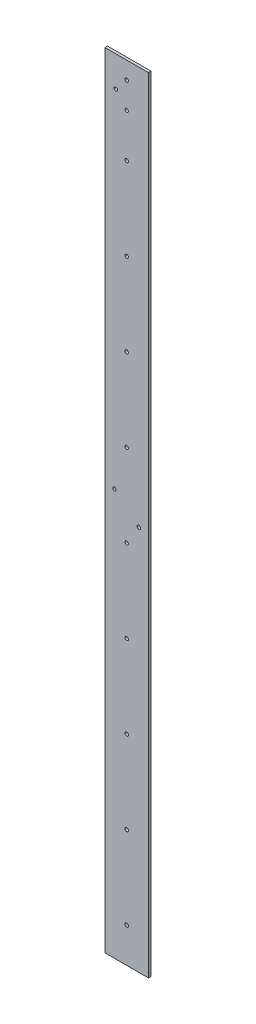
ISO-10303-21;
HEADER;
FILE_DESCRIPTION(('STEP AP214'),'2;1');
FILE_NAME('part.step','',(''),(''),'','','');
FILE_SCHEMA(('AUTOMOTIVE_DESIGN { 1 0 10303 214 1 1 1 1 }'));
ENDSEC;
DATA;
#1=APPLICATION_CONTEXT('core data for automotive mechanical design processes');
#2=APPLICATION_PROTOCOL_DEFINITION('international standard','automotive_design',2000,#1);
#3=PRODUCT_CONTEXT('',#1,'mechanical');
#4=PRODUCT('Part','Part','',(#3));
#5=PRODUCT_RELATED_PRODUCT_CATEGORY('part','',(#4));
#6=PRODUCT_DEFINITION_FORMATION('','',#4);
#7=PRODUCT_DEFINITION_CONTEXT('part definition',#1,'design');
#8=PRODUCT_DEFINITION('design','',#6,#7);
#9=PRODUCT_DEFINITION_SHAPE('','',#8);
#10=(LENGTH_UNIT() NAMED_UNIT(*) SI_UNIT(.MILLI.,.METRE.));
#11=(NAMED_UNIT(*) PLANE_ANGLE_UNIT() SI_UNIT($,.RADIAN.));
#12=(NAMED_UNIT(*) SI_UNIT($,.STERADIAN.) SOLID_ANGLE_UNIT());
#13=UNCERTAINTY_MEASURE_WITH_UNIT(LENGTH_MEASURE(1.E-05),#10,'distance_accuracy_value','');
#14=(GEOMETRIC_REPRESENTATION_CONTEXT(3) GLOBAL_UNCERTAINTY_ASSIGNED_CONTEXT((#13)) GLOBAL_UNIT_ASSIGNED_CONTEXT((#10,
#11,#12)) REPRESENTATION_CONTEXT('',''));
#15=CARTESIAN_POINT('',(0.,0.,0.));
#16=DIRECTION('',(0.,0.,1.));
#17=DIRECTION('',(1.,0.,0.));
#18=AXIS2_PLACEMENT_3D('',#15,#16,#17);
#19=CARTESIAN_POINT('',(-24.6280382553152,450.278971308513,3.));
#20=DIRECTION('',(1.,0.,0.));
#21=DIRECTION('',(0.,1.,0.));
#22=AXIS2_PLACEMENT_3D('',#19,#20,#21);
#23=PLANE('',#22);
#24=DIRECTION('',(0.,-1.,0.));
#25=VECTOR('',#24,1.);
#26=CARTESIAN_POINT('',(-24.6280382553152,450.278971308513,0.));
#27=LINE('',#26,#25);
#28=CARTESIAN_POINT('',(-24.6280382553152,450.278971308513,0.));
#29=VERTEX_POINT('',#28);
#30=CARTESIAN_POINT('',(-24.6280382553117,-449.721028691487,0.));
#31=VERTEX_POINT('',#30);
#32=EDGE_CURVE('E96',#29,#31,#27,.T.);
#33=ORIENTED_EDGE('',*,*,#32,.T.);
#34=DIRECTION('',(0.,0.,-1.));
#35=VECTOR('',#34,1.);
#36=CARTESIAN_POINT('',(-24.6280382553117,-449.721028691487,3.));
#37=LINE('',#36,#35);
#38=CARTESIAN_POINT('',(-24.6280382553117,-449.721028691487,3.));
#39=VERTEX_POINT('',#38);
#40=EDGE_CURVE('E11',#39,#31,#37,.T.);
#41=ORIENTED_EDGE('',*,*,#40,.F.);
#42=DIRECTION('',(0.,-1.,0.));
#43=VECTOR('',#42,1.);
#44=CARTESIAN_POINT('',(-24.6280382553152,450.278971308513,3.));
#45=LINE('',#44,#43);
#46=CARTESIAN_POINT('',(-24.6280382553152,450.278971308513,3.));
#47=VERTEX_POINT('',#46);
#48=EDGE_CURVE('E84',#47,#39,#45,.T.);
#49=ORIENTED_EDGE('',*,*,#48,.F.);
#50=DIRECTION('',(0.,0.,-1.));
#51=VECTOR('',#50,1.);
#52=CARTESIAN_POINT('',(-24.6280382553152,450.278971308513,3.));
#53=LINE('',#52,#51);
#54=EDGE_CURVE('E92',#47,#29,#53,.T.);
#55=ORIENTED_EDGE('',*,*,#54,.T.);
#56=EDGE_LOOP('',(#33,#41,#49,#55));
#57=FACE_BOUND('',#56,.T.);
#58=ADVANCED_FACE('F33',(#57),#23,.F.);
#59=CARTESIAN_POINT('',(-24.6280382553117,-449.721028691487,3.));
#60=DIRECTION('',(0.,1.,0.));
#61=DIRECTION('',(-1.,0.,0.));
#62=AXIS2_PLACEMENT_3D('',#59,#60,#61);
#63=PLANE('',#62);
#64=DIRECTION('',(1.,0.,0.));
#65=VECTOR('',#64,1.);
#66=CARTESIAN_POINT('',(-24.6280382553117,-449.721028691487,0.));
#67=LINE('',#66,#65);
#68=CARTESIAN_POINT('',(25.3719617446855,-449.721028691486,0.));
#69=VERTEX_POINT('',#68);
#70=EDGE_CURVE('E88',#31,#69,#67,.T.);
#71=ORIENTED_EDGE('',*,*,#70,.T.);
#72=DIRECTION('',(0.,0.,-1.));
#73=VECTOR('',#72,1.);
#74=CARTESIAN_POINT('',(25.3719617446855,-449.721028691486,3.));
#75=LINE('',#74,#73);
#76=CARTESIAN_POINT('',(25.3719617446855,-449.721028691486,3.));
#77=VERTEX_POINT('',#76);
#78=EDGE_CURVE('E41',#77,#69,#75,.T.);
#79=ORIENTED_EDGE('',*,*,#78,.F.);
#80=DIRECTION('',(1.,0.,0.));
#81=VECTOR('',#80,1.);
#82=CARTESIAN_POINT('',(-24.6280382553117,-449.721028691487,3.));
#83=LINE('',#82,#81);
#84=EDGE_CURVE('E79',#39,#77,#83,.T.);
#85=ORIENTED_EDGE('',*,*,#84,.F.);
#86=ORIENTED_EDGE('',*,*,#40,.T.);
#87=EDGE_LOOP('',(#71,#79,#85,#86));
#88=FACE_BOUND('',#87,.T.);
#89=ADVANCED_FACE('F87',(#88),#63,.F.);
#90=CARTESIAN_POINT('',(25.3719617446855,-449.721028691486,3.));
#91=DIRECTION('',(-1.,0.,0.));
#92=DIRECTION('',(0.,0.,1.));
#93=AXIS2_PLACEMENT_3D('',#90,#91,#92);
#94=PLANE('',#93);
#95=DIRECTION('',(0.,1.,0.));
#96=VECTOR('',#95,1.);
#97=CARTESIAN_POINT('',(25.3719617446855,-449.721028691486,0.));
#98=LINE('',#97,#96);
#99=CARTESIAN_POINT('',(25.3719617446855,450.278971308513,0.));
#100=VERTEX_POINT('',#99);
#101=EDGE_CURVE('E66',#69,#100,#98,.T.);
#102=ORIENTED_EDGE('',*,*,#101,.T.);
#103=DIRECTION('',(0.,0.,-1.));
#104=VECTOR('',#103,1.);
#105=CARTESIAN_POINT('',(25.3719617446855,450.278971308513,3.));
#106=LINE('',#105,#104);
#107=CARTESIAN_POINT('',(25.3719617446855,450.278971308513,3.));
#108=VERTEX_POINT('',#107);
#109=EDGE_CURVE('E89',#108,#100,#106,.T.);
#110=ORIENTED_EDGE('',*,*,#109,.F.);
#111=DIRECTION('',(0.,1.,0.));
#112=VECTOR('',#111,1.);
#113=CARTESIAN_POINT('',(25.3719617446855,-449.721028691486,3.));
#114=LINE('',#113,#112);
#115=EDGE_CURVE('E82',#77,#108,#114,.T.);
#116=ORIENTED_EDGE('',*,*,#115,.F.);
#117=ORIENTED_EDGE('',*,*,#78,.T.);
#118=EDGE_LOOP('',(#102,#110,#116,#117));
#119=FACE_BOUND('',#118,.T.);
#120=ADVANCED_FACE('F90',(#119),#94,.F.);
#121=CARTESIAN_POINT('',(25.3719617446855,450.278971308513,3.));
#122=DIRECTION('',(0.,-1.,0.));
#123=DIRECTION('',(0.,0.,-1.));
#124=AXIS2_PLACEMENT_3D('',#121,#122,#123);
#125=PLANE('',#124);
#126=DIRECTION('',(-1.,0.,0.));
#127=VECTOR('',#126,1.);
#128=CARTESIAN_POINT('',(25.3719617446855,450.278971308513,0.));
#129=LINE('',#128,#127);
#130=EDGE_CURVE('E72',#100,#29,#129,.T.);
#131=ORIENTED_EDGE('',*,*,#130,.T.);
#132=ORIENTED_EDGE('',*,*,#54,.F.);
#133=DIRECTION('',(-1.,0.,0.));
#134=VECTOR('',#133,1.);
#135=CARTESIAN_POINT('',(25.3719617446855,450.278971308513,3.));
#136=LINE('',#135,#134);
#137=EDGE_CURVE('E49',#108,#47,#136,.T.);
#138=ORIENTED_EDGE('',*,*,#137,.F.);
#139=ORIENTED_EDGE('',*,*,#109,.T.);
#140=EDGE_LOOP('',(#131,#132,#138,#139));
#141=FACE_BOUND('',#140,.T.);
#142=ADVANCED_FACE('F104',(#141),#125,.F.);
#143=CARTESIAN_POINT('',(0.,0.,3.));
#144=DIRECTION('',(0.,0.,1.));
#145=DIRECTION('',(1.,0.,0.));
#146=AXIS2_PLACEMENT_3D('',#143,#144,#145);
#147=PLANE('',#146);
#148=CARTESIAN_POINT('',(0.371961744698737,430.278971308513,3.));
#149=DIRECTION('',(0.,0.,1.));
#150=DIRECTION('',(1.,0.,0.));
#151=AXIS2_PLACEMENT_3D('',#148,#149,#150);
#152=CIRCLE('',#151,1.99999999998372);
#153=CARTESIAN_POINT('',(2.37196174468246,430.278971308513,3.));
#154=VERTEX_POINT('',#153);
#155=EDGE_CURVE('E157',#154,#154,#152,.T.);
#156=ORIENTED_EDGE('',*,*,#155,.F.);
#157=EDGE_LOOP('',(#156));
#158=FACE_BOUND('',#157,.T.);
#159=CARTESIAN_POINT('',(-12.1280382552911,415.278971308477,3.));
#160=DIRECTION('',(0.,0.,1.));
#161=DIRECTION('',(1.,0.,0.));
#162=AXIS2_PLACEMENT_3D('',#159,#160,#161);
#163=CIRCLE('',#162,1.99999999998599);
#164=CARTESIAN_POINT('',(-10.1280382553051,415.278971308477,3.));
#165=VERTEX_POINT('',#164);
#166=EDGE_CURVE('E151',#165,#165,#163,.T.);
#167=ORIENTED_EDGE('',*,*,#166,.F.);
#168=EDGE_LOOP('',(#167));
#169=FACE_BOUND('',#168,.T.);
#170=CARTESIAN_POINT('',(0.371961744685135,350.278971308442,3.));
#171=DIRECTION('',(0.,0.,1.));
#172=DIRECTION('',(1.,0.,0.));
#173=AXIS2_PLACEMENT_3D('',#170,#171,#172);
#174=CIRCLE('',#173,2.00000000002091);
#175=CARTESIAN_POINT('',(2.37196174470604,350.278971308442,3.));
#176=VERTEX_POINT('',#175);
#177=EDGE_CURVE('E145',#176,#176,#174,.T.);
#178=ORIENTED_EDGE('',*,*,#177,.F.);
#179=EDGE_LOOP('',(#178));
#180=FACE_BOUND('',#179,.T.);
#181=CARTESIAN_POINT('',(0.37196174468613,255.278971308442,3.));
#182=DIRECTION('',(0.,0.,1.));
#183=DIRECTION('',(1.,0.,0.));
#184=AXIS2_PLACEMENT_3D('',#181,#182,#183);
#185=CIRCLE('',#184,2.0000000000209);
#186=CARTESIAN_POINT('',(2.37196174470704,255.278971308442,3.));
#187=VERTEX_POINT('',#186);
#188=EDGE_CURVE('E139',#187,#187,#185,.T.);
#189=ORIENTED_EDGE('',*,*,#188,.F.);
#190=EDGE_LOOP('',(#189));
#191=FACE_BOUND('',#190,.T.);
#192=CARTESIAN_POINT('',(0.371961744687126,160.278971308442,3.));
#193=DIRECTION('',(0.,0.,1.));
#194=DIRECTION('',(1.,0.,0.));
#195=AXIS2_PLACEMENT_3D('',#192,#193,#194);
#196=CIRCLE('',#195,2.00000000002091);
#197=CARTESIAN_POINT('',(2.37196174470803,160.278971308442,3.));
#198=VERTEX_POINT('',#197);
#199=EDGE_CURVE('E133',#198,#198,#196,.T.);
#200=ORIENTED_EDGE('',*,*,#199,.F.);
#201=EDGE_LOOP('',(#200));
#202=FACE_BOUND('',#201,.T.);
#203=CARTESIAN_POINT('',(0.371961744688121,65.2789713084417,3.));
#204=DIRECTION('',(0.,0.,1.));
#205=DIRECTION('',(1.,0.,0.));
#206=AXIS2_PLACEMENT_3D('',#203,#204,#205);
#207=CIRCLE('',#206,2.0000000000209);
#208=CARTESIAN_POINT('',(2.37196174470903,65.2789713084417,3.));
#209=VERTEX_POINT('',#208);
#210=EDGE_CURVE('E127',#209,#209,#207,.T.);
#211=ORIENTED_EDGE('',*,*,#210,.F.);
#212=EDGE_LOOP('',(#211));
#213=FACE_BOUND('',#212,.T.);
#214=CARTESIAN_POINT('',(0.371961744689116,-29.7210286915583,3.));
#215=DIRECTION('',(0.,0.,1.));
#216=DIRECTION('',(1.,0.,0.));
#217=AXIS2_PLACEMENT_3D('',#214,#215,#216);
#218=CIRCLE('',#217,2.00000000002091);
#219=CARTESIAN_POINT('',(2.37196174471002,-29.7210286915583,3.));
#220=VERTEX_POINT('',#219);
#221=EDGE_CURVE('E119',#220,#220,#218,.T.);
#222=ORIENTED_EDGE('',*,*,#221,.F.);
#223=EDGE_LOOP('',(#222));
#224=FACE_BOUND('',#223,.T.);
#225=CARTESIAN_POINT('',(0.371961744690111,-124.721028691558,3.));
#226=DIRECTION('',(0.,0.,1.));
#227=DIRECTION('',(1.,0.,0.));
#228=AXIS2_PLACEMENT_3D('',#225,#226,#227);
#229=CIRCLE('',#228,2.00000000002091);
#230=CARTESIAN_POINT('',(2.37196174471102,-124.721028691558,3.));
#231=VERTEX_POINT('',#230);
#232=EDGE_CURVE('E120',#231,#231,#229,.T.);
#233=ORIENTED_EDGE('',*,*,#232,.F.);
#234=EDGE_LOOP('',(#233));
#235=FACE_BOUND('',#234,.T.);
#236=CARTESIAN_POINT('',(14.3719617446852,-7.20091070659768,3.));
#237=DIRECTION('',(0.,0.,1.));
#238=DIRECTION('',(1.,0.,0.));
#239=AXIS2_PLACEMENT_3D('',#236,#237,#238);
#240=CIRCLE('',#239,2.);
#241=CARTESIAN_POINT('',(16.3719617446852,-7.20091070659768,3.));
#242=VERTEX_POINT('',#241);
#243=EDGE_CURVE('E167',#242,#242,#240,.T.);
#244=ORIENTED_EDGE('',*,*,#243,.F.);
#245=EDGE_LOOP('',(#244));
#246=FACE_BOUND('',#245,.T.);
#247=CARTESIAN_POINT('',(0.371961744693096,-409.721028691558,3.));
#248=DIRECTION('',(0.,0.,1.));
#249=DIRECTION('',(1.,0.,0.));
#250=AXIS2_PLACEMENT_3D('',#247,#248,#249);
#251=CIRCLE('',#250,2.00000000002091);
#252=CARTESIAN_POINT('',(2.371961744714,-409.721028691558,3.));
#253=VERTEX_POINT('',#252);
#254=EDGE_CURVE('E186',#253,#253,#251,.T.);
#255=ORIENTED_EDGE('',*,*,#254,.F.);
#256=EDGE_LOOP('',(#255));
#257=FACE_BOUND('',#256,.T.);
#258=CARTESIAN_POINT('',(0.371961744692101,-314.721028691558,3.));
#259=DIRECTION('',(0.,0.,1.));
#260=DIRECTION('',(1.,0.,0.));
#261=AXIS2_PLACEMENT_3D('',#258,#259,#260);
#262=CIRCLE('',#261,2.00000000002091);
#263=CARTESIAN_POINT('',(2.37196174471301,-314.721028691558,3.));
#264=VERTEX_POINT('',#263);
#265=EDGE_CURVE('E175',#264,#264,#262,.T.);
#266=ORIENTED_EDGE('',*,*,#265,.F.);
#267=EDGE_LOOP('',(#266));
#268=FACE_BOUND('',#267,.T.);
#269=CARTESIAN_POINT('',(0.371961744691106,-219.721028691558,3.));
#270=DIRECTION('',(0.,0.,1.));
#271=DIRECTION('',(1.,0.,0.));
#272=AXIS2_PLACEMENT_3D('',#269,#270,#271);
#273=CIRCLE('',#272,2.00000000002091);
#274=CARTESIAN_POINT('',(2.37196174471201,-219.721028691558,3.));
#275=VERTEX_POINT('',#274);
#276=EDGE_CURVE('E174',#275,#275,#273,.T.);
#277=ORIENTED_EDGE('',*,*,#276,.F.);
#278=EDGE_LOOP('',(#277));
#279=FACE_BOUND('',#278,.T.);
#280=CARTESIAN_POINT('',(-13.6280382553148,16.9275078752907,3.));
#281=DIRECTION('',(0.,0.,1.));
#282=DIRECTION('',(1.,0.,0.));
#283=AXIS2_PLACEMENT_3D('',#280,#281,#282);
#284=CIRCLE('',#283,2.);
#285=CARTESIAN_POINT('',(-11.6280382553148,16.9275078752907,3.));
#286=VERTEX_POINT('',#285);
#287=EDGE_CURVE('E168',#286,#286,#284,.T.);
#288=ORIENTED_EDGE('',*,*,#287,.F.);
#289=EDGE_LOOP('',(#288));
#290=FACE_BOUND('',#289,.T.);
#291=CARTESIAN_POINT('',(0.371961744698751,400.278971308442,3.));
#292=DIRECTION('',(0.,0.,1.));
#293=DIRECTION('',(1.,0.,0.));
#294=AXIS2_PLACEMENT_3D('',#291,#292,#293);
#295=CIRCLE('',#294,2.00000000000463);
#296=CARTESIAN_POINT('',(2.37196174470338,400.278971308442,3.));
#297=VERTEX_POINT('',#296);
#298=EDGE_CURVE('E112',#297,#297,#295,.T.);
#299=ORIENTED_EDGE('',*,*,#298,.F.);
#300=EDGE_LOOP('',(#299));
#301=FACE_BOUND('',#300,.T.);
#302=ORIENTED_EDGE('',*,*,#48,.T.);
#303=ORIENTED_EDGE('',*,*,#84,.T.);
#304=ORIENTED_EDGE('',*,*,#115,.T.);
#305=ORIENTED_EDGE('',*,*,#137,.T.);
#306=EDGE_LOOP('',(#302,#303,#304,#305));
#307=FACE_BOUND('',#306,.T.);
#308=ADVANCED_FACE('F80',(#158,#169,#180,#191,#202,#213,#224,#235,#246,#257,#268,#279,#290,#301,
#307),#147,.T.);
#309=CARTESIAN_POINT('',(0.,0.,0.));
#310=DIRECTION('',(0.,0.,1.));
#311=DIRECTION('',(1.,0.,0.));
#312=AXIS2_PLACEMENT_3D('',#309,#310,#311);
#313=PLANE('',#312);
#314=CARTESIAN_POINT('',(0.371961744698737,430.278971308513,0.));
#315=DIRECTION('',(0.,0.,1.));
#316=DIRECTION('',(1.,0.,0.));
#317=AXIS2_PLACEMENT_3D('',#314,#315,#316);
#318=CIRCLE('',#317,1.99999999998372);
#319=CARTESIAN_POINT('',(2.37196174468246,430.278971308513,0.));
#320=VERTEX_POINT('',#319);
#321=EDGE_CURVE('E115',#320,#320,#318,.F.);
#322=ORIENTED_EDGE('',*,*,#321,.F.);
#323=EDGE_LOOP('',(#322));
#324=FACE_BOUND('',#323,.T.);
#325=CARTESIAN_POINT('',(-12.1280382552911,415.278971308477,0.));
#326=DIRECTION('',(0.,0.,1.));
#327=DIRECTION('',(1.,0.,0.));
#328=AXIS2_PLACEMENT_3D('',#325,#326,#327);
#329=CIRCLE('',#328,1.99999999998599);
#330=CARTESIAN_POINT('',(-10.1280382553051,415.278971308477,0.));
#331=VERTEX_POINT('',#330);
#332=EDGE_CURVE('E154',#331,#331,#329,.F.);
#333=ORIENTED_EDGE('',*,*,#332,.F.);
#334=EDGE_LOOP('',(#333));
#335=FACE_BOUND('',#334,.T.);
#336=CARTESIAN_POINT('',(0.371961744685135,350.278971308442,0.));
#337=DIRECTION('',(0.,0.,1.));
#338=DIRECTION('',(1.,0.,0.));
#339=AXIS2_PLACEMENT_3D('',#336,#337,#338);
#340=CIRCLE('',#339,2.00000000002091);
#341=CARTESIAN_POINT('',(2.37196174470604,350.278971308442,0.));
#342=VERTEX_POINT('',#341);
#343=EDGE_CURVE('E148',#342,#342,#340,.F.);
#344=ORIENTED_EDGE('',*,*,#343,.F.);
#345=EDGE_LOOP('',(#344));
#346=FACE_BOUND('',#345,.T.);
#347=CARTESIAN_POINT('',(0.37196174468613,255.278971308442,0.));
#348=DIRECTION('',(0.,0.,1.));
#349=DIRECTION('',(1.,0.,0.));
#350=AXIS2_PLACEMENT_3D('',#347,#348,#349);
#351=CIRCLE('',#350,2.0000000000209);
#352=CARTESIAN_POINT('',(2.37196174470704,255.278971308442,0.));
#353=VERTEX_POINT('',#352);
#354=EDGE_CURVE('E142',#353,#353,#351,.F.);
#355=ORIENTED_EDGE('',*,*,#354,.F.);
#356=EDGE_LOOP('',(#355));
#357=FACE_BOUND('',#356,.T.);
#358=CARTESIAN_POINT('',(0.371961744687126,160.278971308442,0.));
#359=DIRECTION('',(0.,0.,1.));
#360=DIRECTION('',(1.,0.,0.));
#361=AXIS2_PLACEMENT_3D('',#358,#359,#360);
#362=CIRCLE('',#361,2.00000000002091);
#363=CARTESIAN_POINT('',(2.37196174470803,160.278971308442,0.));
#364=VERTEX_POINT('',#363);
#365=EDGE_CURVE('E136',#364,#364,#362,.F.);
#366=ORIENTED_EDGE('',*,*,#365,.F.);
#367=EDGE_LOOP('',(#366));
#368=FACE_BOUND('',#367,.T.);
#369=CARTESIAN_POINT('',(0.371961744688121,65.2789713084417,0.));
#370=DIRECTION('',(0.,0.,1.));
#371=DIRECTION('',(1.,0.,0.));
#372=AXIS2_PLACEMENT_3D('',#369,#370,#371);
#373=CIRCLE('',#372,2.0000000000209);
#374=CARTESIAN_POINT('',(2.37196174470903,65.2789713084417,0.));
#375=VERTEX_POINT('',#374);
#376=EDGE_CURVE('E130',#375,#375,#373,.F.);
#377=ORIENTED_EDGE('',*,*,#376,.F.);
#378=EDGE_LOOP('',(#377));
#379=FACE_BOUND('',#378,.T.);
#380=CARTESIAN_POINT('',(0.371961744689116,-29.7210286915583,0.));
#381=DIRECTION('',(0.,0.,1.));
#382=DIRECTION('',(1.,0.,0.));
#383=AXIS2_PLACEMENT_3D('',#380,#381,#382);
#384=CIRCLE('',#383,2.00000000002091);
#385=CARTESIAN_POINT('',(2.37196174471002,-29.7210286915583,0.));
#386=VERTEX_POINT('',#385);
#387=EDGE_CURVE('E124',#386,#386,#384,.F.);
#388=ORIENTED_EDGE('',*,*,#387,.F.);
#389=EDGE_LOOP('',(#388));
#390=FACE_BOUND('',#389,.T.);
#391=CARTESIAN_POINT('',(0.371961744690111,-124.721028691558,0.));
#392=DIRECTION('',(0.,0.,1.));
#393=DIRECTION('',(1.,0.,0.));
#394=AXIS2_PLACEMENT_3D('',#391,#392,#393);
#395=CIRCLE('',#394,2.00000000002091);
#396=CARTESIAN_POINT('',(2.37196174471102,-124.721028691558,0.));
#397=VERTEX_POINT('',#396);
#398=EDGE_CURVE('E116',#397,#397,#395,.F.);
#399=ORIENTED_EDGE('',*,*,#398,.F.);
#400=EDGE_LOOP('',(#399));
#401=FACE_BOUND('',#400,.T.);
#402=CARTESIAN_POINT('',(14.3719617446852,-7.20091070659768,0.));
#403=DIRECTION('',(0.,0.,1.));
#404=DIRECTION('',(1.,0.,0.));
#405=AXIS2_PLACEMENT_3D('',#402,#403,#404);
#406=CIRCLE('',#405,2.);
#407=CARTESIAN_POINT('',(16.3719617446852,-7.20091070659768,0.));
#408=VERTEX_POINT('',#407);
#409=EDGE_CURVE('E183',#408,#408,#406,.F.);
#410=ORIENTED_EDGE('',*,*,#409,.F.);
#411=EDGE_LOOP('',(#410));
#412=FACE_BOUND('',#411,.T.);
#413=CARTESIAN_POINT('',(0.371961744693096,-409.721028691558,0.));
#414=DIRECTION('',(0.,0.,1.));
#415=DIRECTION('',(1.,0.,0.));
#416=AXIS2_PLACEMENT_3D('',#413,#414,#415);
#417=CIRCLE('',#416,2.00000000002091);
#418=CARTESIAN_POINT('',(2.371961744714,-409.721028691558,0.));
#419=VERTEX_POINT('',#418);
#420=EDGE_CURVE('E178',#419,#419,#417,.F.);
#421=ORIENTED_EDGE('',*,*,#420,.F.);
#422=EDGE_LOOP('',(#421));
#423=FACE_BOUND('',#422,.T.);
#424=CARTESIAN_POINT('',(0.371961744692101,-314.721028691558,0.));
#425=DIRECTION('',(0.,0.,1.));
#426=DIRECTION('',(1.,0.,0.));
#427=AXIS2_PLACEMENT_3D('',#424,#425,#426);
#428=CIRCLE('',#427,2.00000000002091);
#429=CARTESIAN_POINT('',(2.37196174471301,-314.721028691558,0.));
#430=VERTEX_POINT('',#429);
#431=EDGE_CURVE('E171',#430,#430,#428,.F.);
#432=ORIENTED_EDGE('',*,*,#431,.F.);
#433=EDGE_LOOP('',(#432));
#434=FACE_BOUND('',#433,.T.);
#435=CARTESIAN_POINT('',(0.371961744691106,-219.721028691558,0.));
#436=DIRECTION('',(0.,0.,1.));
#437=DIRECTION('',(1.,0.,0.));
#438=AXIS2_PLACEMENT_3D('',#435,#436,#437);
#439=CIRCLE('',#438,2.00000000002091);
#440=CARTESIAN_POINT('',(2.37196174471201,-219.721028691558,0.));
#441=VERTEX_POINT('',#440);
#442=EDGE_CURVE('E123',#441,#441,#439,.F.);
#443=ORIENTED_EDGE('',*,*,#442,.F.);
#444=EDGE_LOOP('',(#443));
#445=FACE_BOUND('',#444,.T.);
#446=CARTESIAN_POINT('',(-13.6280382553148,16.9275078752907,0.));
#447=DIRECTION('',(0.,0.,1.));
#448=DIRECTION('',(1.,0.,0.));
#449=AXIS2_PLACEMENT_3D('',#446,#447,#448);
#450=CIRCLE('',#449,2.);
#451=CARTESIAN_POINT('',(-11.6280382553148,16.9275078752907,0.));
#452=VERTEX_POINT('',#451);
#453=EDGE_CURVE('E164',#452,#452,#450,.F.);
#454=ORIENTED_EDGE('',*,*,#453,.F.);
#455=EDGE_LOOP('',(#454));
#456=FACE_BOUND('',#455,.T.);
#457=CARTESIAN_POINT('',(0.371961744698751,400.278971308442,0.));
#458=DIRECTION('',(0.,0.,1.));
#459=DIRECTION('',(1.,0.,0.));
#460=AXIS2_PLACEMENT_3D('',#457,#458,#459);
#461=CIRCLE('',#460,2.00000000000463);
#462=CARTESIAN_POINT('',(2.37196174470338,400.278971308442,0.));
#463=VERTEX_POINT('',#462);
#464=EDGE_CURVE('E99',#463,#463,#461,.F.);
#465=ORIENTED_EDGE('',*,*,#464,.F.);
#466=EDGE_LOOP('',(#465));
#467=FACE_BOUND('',#466,.T.);
#468=ORIENTED_EDGE('',*,*,#32,.F.);
#469=ORIENTED_EDGE('',*,*,#130,.F.);
#470=ORIENTED_EDGE('',*,*,#101,.F.);
#471=ORIENTED_EDGE('',*,*,#70,.F.);
#472=EDGE_LOOP('',(#468,#469,#470,#471));
#473=FACE_BOUND('',#472,.T.);
#474=ADVANCED_FACE('F107',(#324,#335,#346,#357,#368,#379,#390,#401,#412,#423,#434,#445,#456,
#467,#473),#313,.F.);
#475=CARTESIAN_POINT('',(0.371961744698751,400.278971308442,-0.00100000000000013));
#476=DIRECTION('',(0.,0.,1.));
#477=DIRECTION('',(1.,0.,0.));
#478=AXIS2_PLACEMENT_3D('',#475,#476,#477);
#479=CYLINDRICAL_SURFACE('',#478,2.00000000000463);
#480=ORIENTED_EDGE('',*,*,#298,.T.);
#481=EDGE_LOOP('',(#480));
#482=FACE_BOUND('',#481,.T.);
#483=ORIENTED_EDGE('',*,*,#464,.T.);
#484=EDGE_LOOP('',(#483));
#485=FACE_BOUND('',#484,.T.);
#486=ADVANCED_FACE('F209',(#482,#485),#479,.F.);
#487=CARTESIAN_POINT('',(-13.6280382553148,16.9275078752907,-0.00100000000000013));
#488=DIRECTION('',(0.,0.,1.));
#489=DIRECTION('',(1.,0.,0.));
#490=AXIS2_PLACEMENT_3D('',#487,#488,#489);
#491=CYLINDRICAL_SURFACE('',#490,2.);
#492=ORIENTED_EDGE('',*,*,#287,.T.);
#493=EDGE_LOOP('',(#492));
#494=FACE_BOUND('',#493,.T.);
#495=ORIENTED_EDGE('',*,*,#453,.T.);
#496=EDGE_LOOP('',(#495));
#497=FACE_BOUND('',#496,.T.);
#498=ADVANCED_FACE('F212',(#494,#497),#491,.F.);
#499=CARTESIAN_POINT('',(0.371961744691106,-219.721028691558,-0.00100000000000013));
#500=DIRECTION('',(0.,0.,1.));
#501=DIRECTION('',(1.,0.,0.));
#502=AXIS2_PLACEMENT_3D('',#499,#500,#501);
#503=CYLINDRICAL_SURFACE('',#502,2.00000000002091);
#504=ORIENTED_EDGE('',*,*,#276,.T.);
#505=EDGE_LOOP('',(#504));
#506=FACE_BOUND('',#505,.T.);
#507=ORIENTED_EDGE('',*,*,#442,.T.);
#508=EDGE_LOOP('',(#507));
#509=FACE_BOUND('',#508,.T.);
#510=ADVANCED_FACE('F260',(#506,#509),#503,.F.);
#511=CARTESIAN_POINT('',(0.371961744692101,-314.721028691558,-0.00100000000000013));
#512=DIRECTION('',(0.,0.,1.));
#513=DIRECTION('',(1.,0.,0.));
#514=AXIS2_PLACEMENT_3D('',#511,#512,#513);
#515=CYLINDRICAL_SURFACE('',#514,2.00000000002091);
#516=ORIENTED_EDGE('',*,*,#265,.T.);
#517=EDGE_LOOP('',(#516));
#518=FACE_BOUND('',#517,.T.);
#519=ORIENTED_EDGE('',*,*,#431,.T.);
#520=EDGE_LOOP('',(#519));
#521=FACE_BOUND('',#520,.T.);
#522=ADVANCED_FACE('F270',(#518,#521),#515,.F.);
#523=CARTESIAN_POINT('',(0.371961744693096,-409.721028691558,-0.00100000000000013));
#524=DIRECTION('',(0.,0.,1.));
#525=DIRECTION('',(1.,0.,0.));
#526=AXIS2_PLACEMENT_3D('',#523,#524,#525);
#527=CYLINDRICAL_SURFACE('',#526,2.00000000002091);
#528=ORIENTED_EDGE('',*,*,#254,.T.);
#529=EDGE_LOOP('',(#528));
#530=FACE_BOUND('',#529,.T.);
#531=ORIENTED_EDGE('',*,*,#420,.T.);
#532=EDGE_LOOP('',(#531));
#533=FACE_BOUND('',#532,.T.);
#534=ADVANCED_FACE('F194',(#530,#533),#527,.F.);
#535=CARTESIAN_POINT('',(14.3719617446852,-7.20091070659768,-0.00100000000000013));
#536=DIRECTION('',(0.,0.,1.));
#537=DIRECTION('',(1.,0.,0.));
#538=AXIS2_PLACEMENT_3D('',#535,#536,#537);
#539=CYLINDRICAL_SURFACE('',#538,2.);
#540=ORIENTED_EDGE('',*,*,#243,.T.);
#541=EDGE_LOOP('',(#540));
#542=FACE_BOUND('',#541,.T.);
#543=ORIENTED_EDGE('',*,*,#409,.T.);
#544=EDGE_LOOP('',(#543));
#545=FACE_BOUND('',#544,.T.);
#546=ADVANCED_FACE('F289',(#542,#545),#539,.F.);
#547=CARTESIAN_POINT('',(0.371961744690111,-124.721028691558,-0.00100000000000013));
#548=DIRECTION('',(0.,0.,1.));
#549=DIRECTION('',(1.,0.,0.));
#550=AXIS2_PLACEMENT_3D('',#547,#548,#549);
#551=CYLINDRICAL_SURFACE('',#550,2.00000000002091);
#552=ORIENTED_EDGE('',*,*,#232,.T.);
#553=EDGE_LOOP('',(#552));
#554=FACE_BOUND('',#553,.T.);
#555=ORIENTED_EDGE('',*,*,#398,.T.);
#556=EDGE_LOOP('',(#555));
#557=FACE_BOUND('',#556,.T.);
#558=ADVANCED_FACE('F298',(#554,#557),#551,.F.);
#559=CARTESIAN_POINT('',(0.371961744689116,-29.7210286915583,-0.00100000000000013));
#560=DIRECTION('',(0.,0.,1.));
#561=DIRECTION('',(1.,0.,0.));
#562=AXIS2_PLACEMENT_3D('',#559,#560,#561);
#563=CYLINDRICAL_SURFACE('',#562,2.00000000002091);
#564=ORIENTED_EDGE('',*,*,#221,.T.);
#565=EDGE_LOOP('',(#564));
#566=FACE_BOUND('',#565,.T.);
#567=ORIENTED_EDGE('',*,*,#387,.T.);
#568=EDGE_LOOP('',(#567));
#569=FACE_BOUND('',#568,.T.);
#570=ADVANCED_FACE('F308',(#566,#569),#563,.F.);
#571=CARTESIAN_POINT('',(0.371961744688121,65.2789713084417,-0.00100000000000013));
#572=DIRECTION('',(0.,0.,1.));
#573=DIRECTION('',(1.,0.,0.));
#574=AXIS2_PLACEMENT_3D('',#571,#572,#573);
#575=CYLINDRICAL_SURFACE('',#574,2.0000000000209);
#576=ORIENTED_EDGE('',*,*,#210,.T.);
#577=EDGE_LOOP('',(#576));
#578=FACE_BOUND('',#577,.T.);
#579=ORIENTED_EDGE('',*,*,#376,.T.);
#580=EDGE_LOOP('',(#579));
#581=FACE_BOUND('',#580,.T.);
#582=ADVANCED_FACE('F318',(#578,#581),#575,.F.);
#583=CARTESIAN_POINT('',(0.371961744687126,160.278971308442,-0.00100000000000013));
#584=DIRECTION('',(0.,0.,1.));
#585=DIRECTION('',(1.,0.,0.));
#586=AXIS2_PLACEMENT_3D('',#583,#584,#585);
#587=CYLINDRICAL_SURFACE('',#586,2.00000000002091);
#588=ORIENTED_EDGE('',*,*,#199,.T.);
#589=EDGE_LOOP('',(#588));
#590=FACE_BOUND('',#589,.T.);
#591=ORIENTED_EDGE('',*,*,#365,.T.);
#592=EDGE_LOOP('',(#591));
#593=FACE_BOUND('',#592,.T.);
#594=ADVANCED_FACE('F328',(#590,#593),#587,.F.);
#595=CARTESIAN_POINT('',(0.37196174468613,255.278971308442,-0.00100000000000013));
#596=DIRECTION('',(0.,0.,1.));
#597=DIRECTION('',(1.,0.,0.));
#598=AXIS2_PLACEMENT_3D('',#595,#596,#597);
#599=CYLINDRICAL_SURFACE('',#598,2.0000000000209);
#600=ORIENTED_EDGE('',*,*,#188,.T.);
#601=EDGE_LOOP('',(#600));
#602=FACE_BOUND('',#601,.T.);
#603=ORIENTED_EDGE('',*,*,#354,.T.);
#604=EDGE_LOOP('',(#603));
#605=FACE_BOUND('',#604,.T.);
#606=ADVANCED_FACE('F338',(#602,#605),#599,.F.);
#607=CARTESIAN_POINT('',(0.371961744685135,350.278971308442,-0.00100000000000013));
#608=DIRECTION('',(0.,0.,1.));
#609=DIRECTION('',(1.,0.,0.));
#610=AXIS2_PLACEMENT_3D('',#607,#608,#609);
#611=CYLINDRICAL_SURFACE('',#610,2.00000000002091);
#612=ORIENTED_EDGE('',*,*,#177,.T.);
#613=EDGE_LOOP('',(#612));
#614=FACE_BOUND('',#613,.T.);
#615=ORIENTED_EDGE('',*,*,#343,.T.);
#616=EDGE_LOOP('',(#615));
#617=FACE_BOUND('',#616,.T.);
#618=ADVANCED_FACE('F348',(#614,#617),#611,.F.);
#619=CARTESIAN_POINT('',(-12.1280382552911,415.278971308477,-0.00100000000000013));
#620=DIRECTION('',(0.,0.,1.));
#621=DIRECTION('',(1.,0.,0.));
#622=AXIS2_PLACEMENT_3D('',#619,#620,#621);
#623=CYLINDRICAL_SURFACE('',#622,1.99999999998599);
#624=ORIENTED_EDGE('',*,*,#166,.T.);
#625=EDGE_LOOP('',(#624));
#626=FACE_BOUND('',#625,.T.);
#627=ORIENTED_EDGE('',*,*,#332,.T.);
#628=EDGE_LOOP('',(#627));
#629=FACE_BOUND('',#628,.T.);
#630=ADVANCED_FACE('F358',(#626,#629),#623,.F.);
#631=CARTESIAN_POINT('',(0.371961744698737,430.278971308513,-0.00100000000000013));
#632=DIRECTION('',(0.,0.,1.));
#633=DIRECTION('',(1.,0.,0.));
#634=AXIS2_PLACEMENT_3D('',#631,#632,#633);
#635=CYLINDRICAL_SURFACE('',#634,1.99999999998372);
#636=ORIENTED_EDGE('',*,*,#155,.T.);
#637=EDGE_LOOP('',(#636));
#638=FACE_BOUND('',#637,.T.);
#639=ORIENTED_EDGE('',*,*,#321,.T.);
#640=EDGE_LOOP('',(#639));
#641=FACE_BOUND('',#640,.T.);
#642=ADVANCED_FACE('F368',(#638,#641),#635,.F.);
#643=CLOSED_SHELL('',(#58,#89,#120,#142,#308,#474,#486,#498,#510,#522,#534,#546,#558,#570,#582,
#594,#606,#618,#630,#642));
#644=MANIFOLD_SOLID_BREP('B2',#643);
#645=ADVANCED_BREP_SHAPE_REPRESENTATION('',(#18,#644),#14);
#646=SHAPE_DEFINITION_REPRESENTATION(#9,#645);
ENDSEC;
END-ISO-10303-21;
